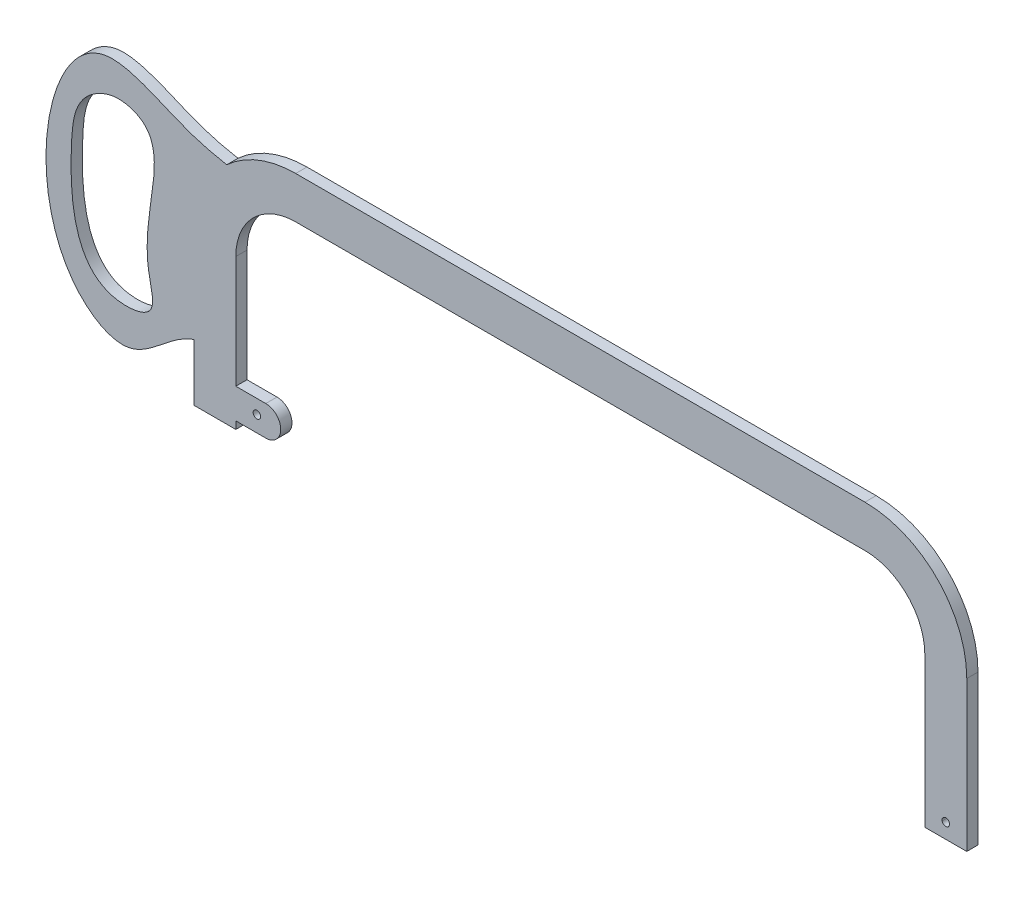
ISO-10303-21;
HEADER;
FILE_DESCRIPTION(('STEP AP214'),'2;1');
FILE_NAME('part.step','',(''),(''),'','','');
FILE_SCHEMA(('AUTOMOTIVE_DESIGN { 1 0 10303 214 1 1 1 1 }'));
ENDSEC;
DATA;
#1=APPLICATION_CONTEXT('core data for automotive mechanical design processes');
#2=APPLICATION_PROTOCOL_DEFINITION('international standard','automotive_design',2000,#1);
#3=PRODUCT_CONTEXT('',#1,'mechanical');
#4=PRODUCT('Part','Part','',(#3));
#5=PRODUCT_RELATED_PRODUCT_CATEGORY('part','',(#4));
#6=PRODUCT_DEFINITION_FORMATION('','',#4);
#7=PRODUCT_DEFINITION_CONTEXT('part definition',#1,'design');
#8=PRODUCT_DEFINITION('design','',#6,#7);
#9=PRODUCT_DEFINITION_SHAPE('','',#8);
#10=(LENGTH_UNIT() NAMED_UNIT(*) SI_UNIT(.MILLI.,.METRE.));
#11=(NAMED_UNIT(*) PLANE_ANGLE_UNIT() SI_UNIT($,.RADIAN.));
#12=(NAMED_UNIT(*) SI_UNIT($,.STERADIAN.) SOLID_ANGLE_UNIT());
#13=UNCERTAINTY_MEASURE_WITH_UNIT(LENGTH_MEASURE(1.E-05),#10,'distance_accuracy_value','');
#14=(GEOMETRIC_REPRESENTATION_CONTEXT(3) GLOBAL_UNCERTAINTY_ASSIGNED_CONTEXT((#13)) GLOBAL_UNIT_ASSIGNED_CONTEXT((#10,
#11,#12)) REPRESENTATION_CONTEXT('',''));
#15=CARTESIAN_POINT('',(0.,0.,0.));
#16=DIRECTION('',(0.,0.,1.));
#17=DIRECTION('',(1.,0.,0.));
#18=AXIS2_PLACEMENT_3D('',#15,#16,#17);
#19=CARTESIAN_POINT('',(124.737182539683,6.35,-2.38125));
#20=DIRECTION('',(0.,0.,1.));
#21=DIRECTION('',(1.,0.,0.));
#22=AXIS2_PLACEMENT_3D('',#19,#20,#21);
#23=CYLINDRICAL_SURFACE('',#22,1.58749999999997);
#24=CARTESIAN_POINT('',(124.737182539683,6.35,-2.38125));
#25=DIRECTION('',(0.,0.,1.));
#26=DIRECTION('',(1.,0.,0.));
#27=AXIS2_PLACEMENT_3D('',#24,#25,#26);
#28=CIRCLE('',#27,1.58749999999997);
#29=CARTESIAN_POINT('',(123.19,5.99449692138973,-2.38125));
#30=VERTEX_POINT('',#29);
#31=CARTESIAN_POINT('',(123.19,6.70550307861028,-2.38125));
#32=VERTEX_POINT('',#31);
#33=EDGE_CURVE('E306',#30,#32,#28,.T.);
#34=ORIENTED_EDGE('',*,*,#33,.F.);
#35=DIRECTION('',(0.,0.,1.));
#36=VECTOR('',#35,1.);
#37=CARTESIAN_POINT('',(123.19,5.99449692138973,-2.38125));
#38=LINE('',#37,#36);
#39=CARTESIAN_POINT('',(123.19,5.99449692138973,2.38125));
#40=VERTEX_POINT('',#39);
#41=EDGE_CURVE('E13',#30,#40,#38,.T.);
#42=ORIENTED_EDGE('',*,*,#41,.T.);
#43=CARTESIAN_POINT('',(124.737182539683,6.35,2.38125));
#44=DIRECTION('',(0.,0.,1.));
#45=DIRECTION('',(1.,0.,0.));
#46=AXIS2_PLACEMENT_3D('',#43,#44,#45);
#47=CIRCLE('',#46,1.58749999999997);
#48=CARTESIAN_POINT('',(123.19,6.70550307861028,2.38125));
#49=VERTEX_POINT('',#48);
#50=EDGE_CURVE('E464',#40,#49,#47,.T.);
#51=ORIENTED_EDGE('',*,*,#50,.T.);
#52=DIRECTION('',(0.,0.,-1.));
#53=VECTOR('',#52,1.);
#54=CARTESIAN_POINT('',(123.19,6.70550307861028,-2.38125));
#55=LINE('',#54,#53);
#56=EDGE_CURVE('E52',#49,#32,#55,.T.);
#57=ORIENTED_EDGE('',*,*,#56,.T.);
#58=EDGE_LOOP('',(#34,#42,#51,#57));
#59=FACE_BOUND('',#58,.T.);
#60=ADVANCED_FACE('F44',(#59),#23,.F.);
#61=CARTESIAN_POINT('',(-176.252817460317,0.,2.38125));
#62=DIRECTION('',(-1.,0.,0.));
#63=DIRECTION('',(0.,-1.,0.));
#64=AXIS2_PLACEMENT_3D('',#61,#62,#63);
#65=PLANE('',#64);
#66=DIRECTION('',(0.,1.,0.));
#67=VECTOR('',#66,1.);
#68=CARTESIAN_POINT('',(-176.252817460317,0.,-2.38125));
#69=LINE('',#68,#67);
#70=CARTESIAN_POINT('',(-176.252817460317,0.,-2.38125));
#71=VERTEX_POINT('',#70);
#72=CARTESIAN_POINT('',(-176.252817460317,3.175,-2.38125));
#73=VERTEX_POINT('',#72);
#74=EDGE_CURVE('E351',#71,#73,#69,.T.);
#75=ORIENTED_EDGE('',*,*,#74,.T.);
#76=DIRECTION('',(0.,0.,1.));
#77=VECTOR('',#76,1.);
#78=CARTESIAN_POINT('',(-176.252817460317,3.175,-25.2765005991963));
#79=LINE('',#78,#77);
#80=CARTESIAN_POINT('',(-176.252817460317,3.175,2.38125));
#81=VERTEX_POINT('',#80);
#82=EDGE_CURVE('E345',#73,#81,#79,.T.);
#83=ORIENTED_EDGE('',*,*,#82,.T.);
#84=DIRECTION('',(0.,1.,0.));
#85=VECTOR('',#84,1.);
#86=CARTESIAN_POINT('',(-176.252817460317,0.,2.38125));
#87=LINE('',#86,#85);
#88=CARTESIAN_POINT('',(-176.252817460317,0.,2.38125));
#89=VERTEX_POINT('',#88);
#90=EDGE_CURVE('E373',#89,#81,#87,.T.);
#91=ORIENTED_EDGE('',*,*,#90,.F.);
#92=DIRECTION('',(0.,0.,-1.));
#93=VECTOR('',#92,1.);
#94=CARTESIAN_POINT('',(-176.252817460317,0.,2.38125));
#95=LINE('',#94,#93);
#96=EDGE_CURVE('E422',#89,#71,#95,.T.);
#97=ORIENTED_EDGE('',*,*,#96,.T.);
#98=EDGE_LOOP('',(#75,#83,#91,#97));
#99=FACE_BOUND('',#98,.T.);
#100=ADVANCED_FACE('F295',(#99),#65,.F.);
#101=CARTESIAN_POINT('',(-194.032817460317,0.,2.38125));
#102=DIRECTION('',(0.,1.,0.));
#103=DIRECTION('',(0.,0.,1.));
#104=AXIS2_PLACEMENT_3D('',#101,#102,#103);
#105=PLANE('',#104);
#106=DIRECTION('',(1.,0.,0.));
#107=VECTOR('',#106,1.);
#108=CARTESIAN_POINT('',(-194.032817460317,0.,-2.38125));
#109=LINE('',#108,#107);
#110=CARTESIAN_POINT('',(-194.032817460317,0.,-2.38125));
#111=VERTEX_POINT('',#110);
#112=EDGE_CURVE('E180',#111,#71,#109,.T.);
#113=ORIENTED_EDGE('',*,*,#112,.T.);
#114=ORIENTED_EDGE('',*,*,#96,.F.);
#115=DIRECTION('',(1.,0.,0.));
#116=VECTOR('',#115,1.);
#117=CARTESIAN_POINT('',(-194.032817460317,0.,2.38125));
#118=LINE('',#117,#116);
#119=CARTESIAN_POINT('',(-194.032817460317,0.,2.38125));
#120=VERTEX_POINT('',#119);
#121=EDGE_CURVE('E184',#120,#89,#118,.T.);
#122=ORIENTED_EDGE('',*,*,#121,.F.);
#123=DIRECTION('',(0.,0.,-1.));
#124=VECTOR('',#123,1.);
#125=CARTESIAN_POINT('',(-194.032817460317,0.,2.38125));
#126=LINE('',#125,#124);
#127=EDGE_CURVE('E427',#120,#111,#126,.T.);
#128=ORIENTED_EDGE('',*,*,#127,.T.);
#129=EDGE_LOOP('',(#113,#114,#122,#128));
#130=FACE_BOUND('',#129,.T.);
#131=ADVANCED_FACE('F46',(#130),#105,.F.);
#132=CARTESIAN_POINT('',(-176.252817460317,15.875,2.38125));
#133=VERTEX_POINT('',#132);
#134=CARTESIAN_POINT('',(-176.252817460317,63.5,2.38125));
#135=VERTEX_POINT('',#134);
#136=EDGE_CURVE('E372',#133,#135,#87,.T.);
#137=ORIENTED_EDGE('',*,*,#136,.F.);
#138=DIRECTION('',(0.,0.,1.));
#139=VECTOR('',#138,1.);
#140=CARTESIAN_POINT('',(-176.252817460317,15.875,-25.2765005991963));
#141=LINE('',#140,#139);
#142=CARTESIAN_POINT('',(-176.252817460317,15.875,-2.38125));
#143=VERTEX_POINT('',#142);
#144=EDGE_CURVE('E338',#143,#133,#141,.T.);
#145=ORIENTED_EDGE('',*,*,#144,.F.);
#146=CARTESIAN_POINT('',(-176.252817460317,63.5,-2.38125));
#147=VERTEX_POINT('',#146);
#148=EDGE_CURVE('E350',#143,#147,#69,.T.);
#149=ORIENTED_EDGE('',*,*,#148,.T.);
#150=DIRECTION('',(0.,0.,-1.));
#151=VECTOR('',#150,1.);
#152=CARTESIAN_POINT('',(-176.252817460317,63.5,2.38125));
#153=LINE('',#152,#151);
#154=EDGE_CURVE('E419',#135,#147,#153,.T.);
#155=ORIENTED_EDGE('',*,*,#154,.F.);
#156=EDGE_LOOP('',(#137,#145,#149,#155));
#157=FACE_BOUND('',#156,.T.);
#158=ADVANCED_FACE('F291',(#157),#65,.F.);
#159=CARTESIAN_POINT('',(-150.852817460317,63.5,2.38125));
#160=DIRECTION('',(0.,0.,-1.));
#161=DIRECTION('',(-1.,0.,0.));
#162=AXIS2_PLACEMENT_3D('',#159,#160,#161);
#163=CYLINDRICAL_SURFACE('',#162,25.4);
#164=CARTESIAN_POINT('',(-150.852817460317,63.5,-2.38125));
#165=DIRECTION('',(0.,0.,-1.));
#166=DIRECTION('',(-1.,0.,0.));
#167=AXIS2_PLACEMENT_3D('',#164,#165,#166);
#168=CIRCLE('',#167,25.4);
#169=CARTESIAN_POINT('',(-150.852817460317,88.9,-2.38125));
#170=VERTEX_POINT('',#169);
#171=EDGE_CURVE('E353',#147,#170,#168,.T.);
#172=ORIENTED_EDGE('',*,*,#171,.T.);
#173=DIRECTION('',(0.,0.,-1.));
#174=VECTOR('',#173,1.);
#175=CARTESIAN_POINT('',(-150.852817460317,88.9,2.38125));
#176=LINE('',#175,#174);
#177=CARTESIAN_POINT('',(-150.852817460317,88.9,2.38125));
#178=VERTEX_POINT('',#177);
#179=EDGE_CURVE('E416',#178,#170,#176,.T.);
#180=ORIENTED_EDGE('',*,*,#179,.F.);
#181=CARTESIAN_POINT('',(-150.852817460317,63.5,2.38125));
#182=DIRECTION('',(0.,0.,-1.));
#183=DIRECTION('',(-1.,0.,0.));
#184=AXIS2_PLACEMENT_3D('',#181,#182,#183);
#185=CIRCLE('',#184,25.4);
#186=EDGE_CURVE('E376',#135,#178,#185,.T.);
#187=ORIENTED_EDGE('',*,*,#186,.F.);
#188=ORIENTED_EDGE('',*,*,#154,.T.);
#189=EDGE_LOOP('',(#172,#180,#187,#188));
#190=FACE_BOUND('',#189,.T.);
#191=ADVANCED_FACE('F288',(#190),#163,.F.);
#192=CARTESIAN_POINT('',(-150.852817460317,88.9,2.38125));
#193=DIRECTION('',(0.,1.,0.));
#194=DIRECTION('',(-1.,0.,0.));
#195=AXIS2_PLACEMENT_3D('',#192,#193,#194);
#196=PLANE('',#195);
#197=DIRECTION('',(1.,0.,0.));
#198=VECTOR('',#197,1.);
#199=CARTESIAN_POINT('',(-150.852817460317,88.9,-2.38125));
#200=LINE('',#199,#198);
#201=CARTESIAN_POINT('',(90.4471825396825,88.9,-2.38125));
#202=VERTEX_POINT('',#201);
#203=EDGE_CURVE('E355',#170,#202,#200,.T.);
#204=ORIENTED_EDGE('',*,*,#203,.T.);
#205=DIRECTION('',(0.,0.,-1.));
#206=VECTOR('',#205,1.);
#207=CARTESIAN_POINT('',(90.4471825396825,88.9,2.38125));
#208=LINE('',#207,#206);
#209=CARTESIAN_POINT('',(90.4471825396825,88.9,2.38125));
#210=VERTEX_POINT('',#209);
#211=EDGE_CURVE('E412',#210,#202,#208,.T.);
#212=ORIENTED_EDGE('',*,*,#211,.F.);
#213=DIRECTION('',(1.,0.,0.));
#214=VECTOR('',#213,1.);
#215=CARTESIAN_POINT('',(-150.852817460317,88.9,2.38125));
#216=LINE('',#215,#214);
#217=EDGE_CURVE('E378',#178,#210,#216,.T.);
#218=ORIENTED_EDGE('',*,*,#217,.F.);
#219=ORIENTED_EDGE('',*,*,#179,.T.);
#220=EDGE_LOOP('',(#204,#212,#218,#219));
#221=FACE_BOUND('',#220,.T.);
#222=ADVANCED_FACE('F284',(#221),#196,.F.);
#223=CARTESIAN_POINT('',(90.4471825396825,63.5,2.38125));
#224=DIRECTION('',(0.,0.,-1.));
#225=DIRECTION('',(-1.,0.,0.));
#226=AXIS2_PLACEMENT_3D('',#223,#224,#225);
#227=CYLINDRICAL_SURFACE('',#226,25.4);
#228=CARTESIAN_POINT('',(90.4471825396825,63.5,-2.38125));
#229=DIRECTION('',(0.,0.,-1.));
#230=DIRECTION('',(1.,0.,0.));
#231=AXIS2_PLACEMENT_3D('',#228,#229,#230);
#232=CIRCLE('',#231,25.4);
#233=CARTESIAN_POINT('',(115.847182539683,63.5,-2.38125));
#234=VERTEX_POINT('',#233);
#235=EDGE_CURVE('E357',#202,#234,#232,.T.);
#236=ORIENTED_EDGE('',*,*,#235,.T.);
#237=DIRECTION('',(0.,0.,-1.));
#238=VECTOR('',#237,1.);
#239=CARTESIAN_POINT('',(115.847182539683,63.5,2.38125));
#240=LINE('',#239,#238);
#241=CARTESIAN_POINT('',(115.847182539683,63.5,2.38125));
#242=VERTEX_POINT('',#241);
#243=EDGE_CURVE('E410',#242,#234,#240,.T.);
#244=ORIENTED_EDGE('',*,*,#243,.F.);
#245=CARTESIAN_POINT('',(90.4471825396825,63.5,2.38125));
#246=DIRECTION('',(0.,0.,-1.));
#247=DIRECTION('',(1.,0.,0.));
#248=AXIS2_PLACEMENT_3D('',#245,#246,#247);
#249=CIRCLE('',#248,25.4);
#250=EDGE_CURVE('E380',#210,#242,#249,.T.);
#251=ORIENTED_EDGE('',*,*,#250,.F.);
#252=ORIENTED_EDGE('',*,*,#211,.T.);
#253=EDGE_LOOP('',(#236,#244,#251,#252));
#254=FACE_BOUND('',#253,.T.);
#255=ADVANCED_FACE('F280',(#254),#227,.F.);
#256=CARTESIAN_POINT('',(115.847182539683,63.5,2.38125));
#257=DIRECTION('',(1.,0.,0.));
#258=DIRECTION('',(0.,0.,-1.));
#259=AXIS2_PLACEMENT_3D('',#256,#257,#258);
#260=PLANE('',#259);
#261=DIRECTION('',(0.,-1.,0.));
#262=VECTOR('',#261,1.);
#263=CARTESIAN_POINT('',(115.847182539683,63.5,-2.38125));
#264=LINE('',#263,#262);
#265=CARTESIAN_POINT('',(115.847182539683,0.,-2.38125));
#266=VERTEX_POINT('',#265);
#267=EDGE_CURVE('E359',#234,#266,#264,.T.);
#268=ORIENTED_EDGE('',*,*,#267,.T.);
#269=DIRECTION('',(0.,0.,-1.));
#270=VECTOR('',#269,1.);
#271=CARTESIAN_POINT('',(115.847182539683,0.,2.38125));
#272=LINE('',#271,#270);
#273=CARTESIAN_POINT('',(115.847182539683,0.,2.38125));
#274=VERTEX_POINT('',#273);
#275=EDGE_CURVE('E407',#274,#266,#272,.T.);
#276=ORIENTED_EDGE('',*,*,#275,.F.);
#277=DIRECTION('',(0.,-1.,0.));
#278=VECTOR('',#277,1.);
#279=CARTESIAN_POINT('',(115.847182539683,63.5,2.38125));
#280=LINE('',#279,#278);
#281=EDGE_CURVE('E382',#242,#274,#280,.T.);
#282=ORIENTED_EDGE('',*,*,#281,.F.);
#283=ORIENTED_EDGE('',*,*,#243,.T.);
#284=EDGE_LOOP('',(#268,#276,#282,#283));
#285=FACE_BOUND('',#284,.T.);
#286=ADVANCED_FACE('F276',(#285),#260,.F.);
#287=CARTESIAN_POINT('',(115.847182539683,0.,2.38125));
#288=DIRECTION('',(0.,1.,0.));
#289=DIRECTION('',(0.,0.,1.));
#290=AXIS2_PLACEMENT_3D('',#287,#288,#289);
#291=PLANE('',#290);
#292=DIRECTION('',(1.,0.,0.));
#293=VECTOR('',#292,1.);
#294=CARTESIAN_POINT('',(115.847182539683,0.,-2.38125));
#295=LINE('',#294,#293);
#296=CARTESIAN_POINT('',(133.627182539683,0.,-2.38125));
#297=VERTEX_POINT('',#296);
#298=EDGE_CURVE('E361',#266,#297,#295,.T.);
#299=ORIENTED_EDGE('',*,*,#298,.T.);
#300=DIRECTION('',(0.,0.,-1.));
#301=VECTOR('',#300,1.);
#302=CARTESIAN_POINT('',(133.627182539683,0.,2.38125));
#303=LINE('',#302,#301);
#304=CARTESIAN_POINT('',(133.627182539683,0.,2.38125));
#305=VERTEX_POINT('',#304);
#306=EDGE_CURVE('E404',#305,#297,#303,.T.);
#307=ORIENTED_EDGE('',*,*,#306,.F.);
#308=DIRECTION('',(1.,0.,0.));
#309=VECTOR('',#308,1.);
#310=CARTESIAN_POINT('',(115.847182539683,0.,2.38125));
#311=LINE('',#310,#309);
#312=EDGE_CURVE('E383',#274,#305,#311,.T.);
#313=ORIENTED_EDGE('',*,*,#312,.F.);
#314=ORIENTED_EDGE('',*,*,#275,.T.);
#315=EDGE_LOOP('',(#299,#307,#313,#314));
#316=FACE_BOUND('',#315,.T.);
#317=ADVANCED_FACE('F272',(#316),#291,.F.);
#318=CARTESIAN_POINT('',(133.627182539683,0.,2.38125));
#319=DIRECTION('',(-1.,0.,0.));
#320=DIRECTION('',(0.,0.,1.));
#321=AXIS2_PLACEMENT_3D('',#318,#319,#320);
#322=PLANE('',#321);
#323=DIRECTION('',(0.,1.,0.));
#324=VECTOR('',#323,1.);
#325=CARTESIAN_POINT('',(133.627182539683,0.,-2.38125));
#326=LINE('',#325,#324);
#327=CARTESIAN_POINT('',(133.627182539683,63.5,-2.38125));
#328=VERTEX_POINT('',#327);
#329=EDGE_CURVE('E363',#297,#328,#326,.T.);
#330=ORIENTED_EDGE('',*,*,#329,.T.);
#331=DIRECTION('',(0.,0.,-1.));
#332=VECTOR('',#331,1.);
#333=CARTESIAN_POINT('',(133.627182539683,63.5,2.38125));
#334=LINE('',#333,#332);
#335=CARTESIAN_POINT('',(133.627182539683,63.5,2.38125));
#336=VERTEX_POINT('',#335);
#337=EDGE_CURVE('E399',#336,#328,#334,.T.);
#338=ORIENTED_EDGE('',*,*,#337,.F.);
#339=DIRECTION('',(0.,1.,0.));
#340=VECTOR('',#339,1.);
#341=CARTESIAN_POINT('',(133.627182539683,0.,2.38125));
#342=LINE('',#341,#340);
#343=EDGE_CURVE('E387',#305,#336,#342,.T.);
#344=ORIENTED_EDGE('',*,*,#343,.F.);
#345=ORIENTED_EDGE('',*,*,#306,.T.);
#346=EDGE_LOOP('',(#330,#338,#344,#345));
#347=FACE_BOUND('',#346,.T.);
#348=ADVANCED_FACE('F268',(#347),#322,.F.);
#349=CARTESIAN_POINT('',(90.4471825396825,63.5,2.38125));
#350=DIRECTION('',(0.,0.,-1.));
#351=DIRECTION('',(-1.,0.,0.));
#352=AXIS2_PLACEMENT_3D('',#349,#350,#351);
#353=CYLINDRICAL_SURFACE('',#352,43.18);
#354=CARTESIAN_POINT('',(90.4471825396825,63.5,-2.38125));
#355=DIRECTION('',(0.,0.,1.));
#356=DIRECTION('',(1.,0.,0.));
#357=AXIS2_PLACEMENT_3D('',#354,#355,#356);
#358=CIRCLE('',#357,43.18);
#359=CARTESIAN_POINT('',(90.4471825396825,106.68,-2.38125));
#360=VERTEX_POINT('',#359);
#361=EDGE_CURVE('E365',#328,#360,#358,.T.);
#362=ORIENTED_EDGE('',*,*,#361,.T.);
#363=DIRECTION('',(0.,0.,-1.));
#364=VECTOR('',#363,1.);
#365=CARTESIAN_POINT('',(90.4471825396825,106.68,2.38125));
#366=LINE('',#365,#364);
#367=CARTESIAN_POINT('',(90.4471825396825,106.68,2.38125));
#368=VERTEX_POINT('',#367);
#369=EDGE_CURVE('E394',#368,#360,#366,.T.);
#370=ORIENTED_EDGE('',*,*,#369,.F.);
#371=CARTESIAN_POINT('',(90.4471825396825,63.5,2.38125));
#372=DIRECTION('',(0.,0.,1.));
#373=DIRECTION('',(1.,0.,0.));
#374=AXIS2_PLACEMENT_3D('',#371,#372,#373);
#375=CIRCLE('',#374,43.18);
#376=EDGE_CURVE('E435',#336,#368,#375,.T.);
#377=ORIENTED_EDGE('',*,*,#376,.F.);
#378=ORIENTED_EDGE('',*,*,#337,.T.);
#379=EDGE_LOOP('',(#362,#370,#377,#378));
#380=FACE_BOUND('',#379,.T.);
#381=ADVANCED_FACE('F264',(#380),#353,.T.);
#382=CARTESIAN_POINT('',(90.4471825396825,106.68,2.38125));
#383=DIRECTION('',(0.,-1.,0.));
#384=DIRECTION('',(1.,0.,0.));
#385=AXIS2_PLACEMENT_3D('',#382,#383,#384);
#386=PLANE('',#385);
#387=DIRECTION('',(-1.,0.,0.));
#388=VECTOR('',#387,1.);
#389=CARTESIAN_POINT('',(90.4471825396825,106.68,-2.38125));
#390=LINE('',#389,#388);
#391=CARTESIAN_POINT('',(-150.852817460317,106.68,-2.38125));
#392=VERTEX_POINT('',#391);
#393=EDGE_CURVE('E367',#360,#392,#390,.T.);
#394=ORIENTED_EDGE('',*,*,#393,.T.);
#395=DIRECTION('',(0.,0.,-1.));
#396=VECTOR('',#395,1.);
#397=CARTESIAN_POINT('',(-150.852817460317,106.68,2.38125));
#398=LINE('',#397,#396);
#399=CARTESIAN_POINT('',(-150.852817460317,106.68,2.38125));
#400=VERTEX_POINT('',#399);
#401=EDGE_CURVE('E400',#400,#392,#398,.T.);
#402=ORIENTED_EDGE('',*,*,#401,.F.);
#403=DIRECTION('',(-1.,0.,0.));
#404=VECTOR('',#403,1.);
#405=CARTESIAN_POINT('',(90.4471825396825,106.68,2.38125));
#406=LINE('',#405,#404);
#407=EDGE_CURVE('E434',#368,#400,#406,.T.);
#408=ORIENTED_EDGE('',*,*,#407,.F.);
#409=ORIENTED_EDGE('',*,*,#369,.T.);
#410=EDGE_LOOP('',(#394,#402,#408,#409));
#411=FACE_BOUND('',#410,.T.);
#412=ADVANCED_FACE('F260',(#411),#386,.F.);
#413=CARTESIAN_POINT('',(-150.852817460317,63.5,2.38125));
#414=DIRECTION('',(0.,0.,-1.));
#415=DIRECTION('',(-1.,0.,0.));
#416=AXIS2_PLACEMENT_3D('',#413,#414,#415);
#417=CYLINDRICAL_SURFACE('',#416,43.18);
#418=CARTESIAN_POINT('',(-150.852817460317,63.5,-2.38125));
#419=DIRECTION('',(0.,0.,1.));
#420=DIRECTION('',(-1.,0.,0.));
#421=AXIS2_PLACEMENT_3D('',#418,#419,#420);
#422=CIRCLE('',#421,43.18);
#423=CARTESIAN_POINT('',(-180.094894680852,95.2712656315155,-2.38125));
#424=VERTEX_POINT('',#423);
#425=EDGE_CURVE('E185',#392,#424,#422,.T.);
#426=ORIENTED_EDGE('',*,*,#425,.T.);
#427=DIRECTION('',(0.,0.,1.));
#428=VECTOR('',#427,1.);
#429=CARTESIAN_POINT('',(-180.094894680852,95.2712656315155,0.));
#430=LINE('',#429,#428);
#431=CARTESIAN_POINT('',(-180.094894680852,95.2712656315155,2.38125));
#432=VERTEX_POINT('',#431);
#433=EDGE_CURVE('E194',#424,#432,#430,.T.);
#434=ORIENTED_EDGE('',*,*,#433,.T.);
#435=CARTESIAN_POINT('',(-150.852817460317,63.5,2.38125));
#436=DIRECTION('',(0.,0.,1.));
#437=DIRECTION('',(-1.,0.,0.));
#438=AXIS2_PLACEMENT_3D('',#435,#436,#437);
#439=CIRCLE('',#438,43.18);
#440=EDGE_CURVE('E429',#400,#432,#439,.T.);
#441=ORIENTED_EDGE('',*,*,#440,.F.);
#442=ORIENTED_EDGE('',*,*,#401,.T.);
#443=EDGE_LOOP('',(#426,#434,#441,#442));
#444=FACE_BOUND('',#443,.T.);
#445=ADVANCED_FACE('F257',(#444),#417,.T.);
#446=CARTESIAN_POINT('',(-194.032817460317,63.5,2.38125));
#447=DIRECTION('',(1.,0.,0.));
#448=DIRECTION('',(0.,1.,0.));
#449=AXIS2_PLACEMENT_3D('',#446,#447,#448);
#450=PLANE('',#449);
#451=DIRECTION('',(0.,-1.,0.));
#452=VECTOR('',#451,1.);
#453=CARTESIAN_POINT('',(-194.032817460317,63.5,2.38125));
#454=LINE('',#453,#452);
#455=CARTESIAN_POINT('',(-194.032817460317,24.1205061199108,2.38125));
#456=VERTEX_POINT('',#455);
#457=EDGE_CURVE('E190',#456,#120,#454,.T.);
#458=ORIENTED_EDGE('',*,*,#457,.F.);
#459=DIRECTION('',(0.,0.,1.));
#460=VECTOR('',#459,1.);
#461=CARTESIAN_POINT('',(-194.032817460317,24.1205061199112,0.));
#462=LINE('',#461,#460);
#463=CARTESIAN_POINT('',(-194.032817460319,24.1205061199108,-2.38125));
#464=VERTEX_POINT('',#463);
#465=EDGE_CURVE('E188',#456,#464,#462,.F.);
#466=ORIENTED_EDGE('',*,*,#465,.T.);
#467=DIRECTION('',(0.,-1.,0.));
#468=VECTOR('',#467,1.);
#469=CARTESIAN_POINT('',(-194.032817460317,63.5,-2.38125));
#470=LINE('',#469,#468);
#471=EDGE_CURVE('E172',#464,#111,#470,.T.);
#472=ORIENTED_EDGE('',*,*,#471,.T.);
#473=ORIENTED_EDGE('',*,*,#127,.F.);
#474=EDGE_LOOP('',(#458,#466,#472,#473));
#475=FACE_BOUND('',#474,.T.);
#476=ADVANCED_FACE('F189',(#475),#450,.F.);
#477=CARTESIAN_POINT('',(-150.852817460317,63.5,2.38125));
#478=DIRECTION('',(0.,0.,-1.));
#479=DIRECTION('',(-1.,0.,0.));
#480=AXIS2_PLACEMENT_3D('',#477,#478,#479);
#481=PLANE('',#480);
#482=ORIENTED_EDGE('',*,*,#440,.T.);
#483=CARTESIAN_POINT('',(-163.50008603373,92.9767178813179,2.38125));
#484=CARTESIAN_POINT('',(-174.215818284095,94.2300992189467,2.38125));
#485=CARTESIAN_POINT('',(-196.776448036714,96.8689363638482,2.38125));
#486=CARTESIAN_POINT('',(-252.859222163881,130.124714633944,2.38125));
#487=CARTESIAN_POINT('',(-269.426470803475,29.793267068146,2.38125));
#488=CARTESIAN_POINT('',(-217.090656666542,-1.29085573981712,2.38125));
#489=CARTESIAN_POINT('',(-200.757769768453,26.3378115151783,2.38125));
#490=CARTESIAN_POINT('',(-186.899721404846,24.7198097405488,2.38125));
#491=CARTESIAN_POINT('',(-185.37100561647,24.541323939836,2.38125));
#492=B_SPLINE_CURVE_WITH_KNOTS('',3,(#483,#484,#485,#486,#487,#488,#489,#490,#491),
.UNSPECIFIED.,.F.,.F.,(4,1,1,1,1,1,4),(0.,0.145421676533469,0.306167093916027,0.711218283048218,
0.818840041352885,0.980015794306756,1.),.UNSPECIFIED.);
#493=EDGE_CURVE('E202',#432,#456,#492,.T.);
#494=ORIENTED_EDGE('',*,*,#493,.T.);
#495=ORIENTED_EDGE('',*,*,#457,.T.);
#496=ORIENTED_EDGE('',*,*,#121,.T.);
#497=ORIENTED_EDGE('',*,*,#90,.T.);
#498=DIRECTION('',(1.,0.,0.));
#499=VECTOR('',#498,1.);
#500=CARTESIAN_POINT('',(-176.252817460317,3.175,2.38125));
#501=LINE('',#500,#499);
#502=CARTESIAN_POINT('',(-163.552817460317,3.175,2.38125));
#503=VERTEX_POINT('',#502);
#504=EDGE_CURVE('E322',#81,#503,#501,.T.);
#505=ORIENTED_EDGE('',*,*,#504,.T.);
#506=CARTESIAN_POINT('',(-163.552817460317,9.525,2.38125));
#507=DIRECTION('',(0.,0.,1.));
#508=DIRECTION('',(1.,0.,0.));
#509=AXIS2_PLACEMENT_3D('',#506,#507,#508);
#510=CIRCLE('',#509,6.35);
#511=CARTESIAN_POINT('',(-163.552817460317,15.875,2.38125));
#512=VERTEX_POINT('',#511);
#513=EDGE_CURVE('E327',#503,#512,#510,.T.);
#514=ORIENTED_EDGE('',*,*,#513,.T.);
#515=DIRECTION('',(-1.,0.,0.));
#516=VECTOR('',#515,1.);
#517=CARTESIAN_POINT('',(-176.252817460317,15.875,2.38125));
#518=LINE('',#517,#516);
#519=EDGE_CURVE('E323',#512,#133,#518,.T.);
#520=ORIENTED_EDGE('',*,*,#519,.T.);
#521=ORIENTED_EDGE('',*,*,#136,.T.);
#522=ORIENTED_EDGE('',*,*,#186,.T.);
#523=ORIENTED_EDGE('',*,*,#217,.T.);
#524=ORIENTED_EDGE('',*,*,#250,.T.);
#525=ORIENTED_EDGE('',*,*,#281,.T.);
#526=ORIENTED_EDGE('',*,*,#312,.T.);
#527=ORIENTED_EDGE('',*,*,#343,.T.);
#528=ORIENTED_EDGE('',*,*,#376,.T.);
#529=ORIENTED_EDGE('',*,*,#407,.T.);
#530=EDGE_LOOP('',(#482,#494,#495,#496,#497,#505,#514,#520,#521,#522,#523,#524,#525,#526,#527,
#528,#529));
#531=FACE_BOUND('',#530,.T.);
#532=EDGE_CURVE('E310',#49,#40,#47,.T.);
#533=ORIENTED_EDGE('',*,*,#532,.F.);
#534=ORIENTED_EDGE('',*,*,#50,.F.);
#535=EDGE_LOOP('',(#533,#534));
#536=FACE_BOUND('',#535,.T.);
#537=CARTESIAN_POINT('',(-167.336278270076,9.93855216538009,2.38125));
#538=DIRECTION('',(0.,0.,1.));
#539=DIRECTION('',(1.,0.,0.));
#540=AXIS2_PLACEMENT_3D('',#537,#538,#539);
#541=CIRCLE('',#540,1.58749999999999);
#542=CARTESIAN_POINT('',(-165.748778270076,9.93855216538009,2.38125));
#543=VERTEX_POINT('',#542);
#544=EDGE_CURVE('E313',#543,#543,#541,.T.);
#545=ORIENTED_EDGE('',*,*,#544,.F.);
#546=EDGE_LOOP('',(#545));
#547=FACE_BOUND('',#546,.T.);
#548=CARTESIAN_POINT('',(-241.011953679969,88.8094623745175,2.38125));
#549=CARTESIAN_POINT('',(-244.988611476123,83.6487410239102,2.38125));
#550=CARTESIAN_POINT('',(-247.283551881555,60.1055409584341,2.38125));
#551=CARTESIAN_POINT('',(-244.915722390433,18.8537352838272,2.38125));
#552=CARTESIAN_POINT('',(-208.081682807615,23.1237234693048,2.38125));
#553=CARTESIAN_POINT('',(-220.297957576784,55.3931547391515,2.38125));
#554=CARTESIAN_POINT('',(-201.095560901441,90.7405361068269,2.38125));
#555=CARTESIAN_POINT('',(-229.023756485265,98.1268585883008,2.38125));
#556=CARTESIAN_POINT('',(-237.642234652288,93.1825268480365,2.38125));
#557=CARTESIAN_POINT('',(-241.011953679969,88.8094623745175,2.38125));
#558=B_SPLINE_CURVE_WITH_KNOTS('',3,(#548,#549,#550,#551,#552,#553,#554,#555,#556,#557),
.UNSPECIFIED.,.T.,.F.,(4,1,1,1,1,1,1,4),(0.,0.110817881329757,0.392381603405073,
0.47396519666166,0.559095552804665,0.859488043987518,0.906095736051165,1.),.UNSPECIFIED.);
#559=CARTESIAN_POINT('',(-241.011953679969,88.8094623745175,2.38125));
#560=VERTEX_POINT('',#559);
#561=EDGE_CURVE('E199',#560,#560,#558,.T.);
#562=ORIENTED_EDGE('',*,*,#561,.F.);
#563=EDGE_LOOP('',(#562));
#564=FACE_BOUND('',#563,.T.);
#565=ADVANCED_FACE('F251',(#531,#536,#547,#564),#481,.F.);
#566=CARTESIAN_POINT('',(-150.852817460317,63.5,-2.38125));
#567=DIRECTION('',(0.,0.,-1.));
#568=DIRECTION('',(-1.,0.,0.));
#569=AXIS2_PLACEMENT_3D('',#566,#567,#568);
#570=PLANE('',#569);
#571=ORIENTED_EDGE('',*,*,#471,.F.);
#572=CARTESIAN_POINT('',(-163.50008603373,92.9767178813179,-2.38125));
#573=CARTESIAN_POINT('',(-174.215818284095,94.2300992189467,-2.38125));
#574=CARTESIAN_POINT('',(-196.776448036714,96.8689363638482,-2.38125));
#575=CARTESIAN_POINT('',(-252.859222163881,130.124714633944,-2.38125));
#576=CARTESIAN_POINT('',(-269.426470803475,29.793267068146,-2.38125));
#577=CARTESIAN_POINT('',(-217.090656666542,-1.29085573981712,-2.38125));
#578=CARTESIAN_POINT('',(-200.757769768453,26.3378115151783,-2.38125));
#579=CARTESIAN_POINT('',(-186.899721404846,24.7198097405488,-2.38125));
#580=CARTESIAN_POINT('',(-185.37100561647,24.541323939836,-2.38125));
#581=B_SPLINE_CURVE_WITH_KNOTS('',3,(#572,#573,#574,#575,#576,#577,#578,#579,#580),
.UNSPECIFIED.,.F.,.F.,(4,1,1,1,1,1,4),(0.,0.145421676533469,0.306167093916027,0.711218283048218,
0.818840041352885,0.980015794306756,1.),.UNSPECIFIED.);
#582=EDGE_CURVE('E178',#424,#464,#581,.T.);
#583=ORIENTED_EDGE('',*,*,#582,.F.);
#584=ORIENTED_EDGE('',*,*,#425,.F.);
#585=ORIENTED_EDGE('',*,*,#393,.F.);
#586=ORIENTED_EDGE('',*,*,#361,.F.);
#587=ORIENTED_EDGE('',*,*,#329,.F.);
#588=ORIENTED_EDGE('',*,*,#298,.F.);
#589=ORIENTED_EDGE('',*,*,#267,.F.);
#590=ORIENTED_EDGE('',*,*,#235,.F.);
#591=ORIENTED_EDGE('',*,*,#203,.F.);
#592=ORIENTED_EDGE('',*,*,#171,.F.);
#593=ORIENTED_EDGE('',*,*,#148,.F.);
#594=DIRECTION('',(-1.,0.,0.));
#595=VECTOR('',#594,1.);
#596=CARTESIAN_POINT('',(-176.252817460317,15.875,-2.38125));
#597=LINE('',#596,#595);
#598=CARTESIAN_POINT('',(-163.552817460317,15.875,-2.38125));
#599=VERTEX_POINT('',#598);
#600=EDGE_CURVE('E335',#599,#143,#597,.T.);
#601=ORIENTED_EDGE('',*,*,#600,.F.);
#602=CARTESIAN_POINT('',(-163.552817460317,9.525,-2.38125));
#603=DIRECTION('',(0.,0.,-1.));
#604=DIRECTION('',(-1.,0.,0.));
#605=AXIS2_PLACEMENT_3D('',#602,#603,#604);
#606=CIRCLE('',#605,6.35);
#607=CARTESIAN_POINT('',(-163.552817460317,3.175,-2.38125));
#608=VERTEX_POINT('',#607);
#609=EDGE_CURVE('E340',#608,#599,#606,.F.);
#610=ORIENTED_EDGE('',*,*,#609,.F.);
#611=DIRECTION('',(1.,0.,0.));
#612=VECTOR('',#611,1.);
#613=CARTESIAN_POINT('',(-176.252817460317,3.175,-2.38125));
#614=LINE('',#613,#612);
#615=EDGE_CURVE('E326',#73,#608,#614,.T.);
#616=ORIENTED_EDGE('',*,*,#615,.F.);
#617=ORIENTED_EDGE('',*,*,#74,.F.);
#618=ORIENTED_EDGE('',*,*,#112,.F.);
#619=EDGE_LOOP('',(#571,#583,#584,#585,#586,#587,#588,#589,#590,#591,#592,#593,#601,#610,#616,
#617,#618));
#620=FACE_BOUND('',#619,.T.);
#621=EDGE_CURVE('E309',#32,#30,#28,.T.);
#622=ORIENTED_EDGE('',*,*,#621,.T.);
#623=ORIENTED_EDGE('',*,*,#33,.T.);
#624=EDGE_LOOP('',(#622,#623));
#625=FACE_BOUND('',#624,.T.);
#626=CARTESIAN_POINT('',(-167.336278270076,9.93855216538009,-2.38125));
#627=DIRECTION('',(0.,0.,1.));
#628=DIRECTION('',(1.,0.,0.));
#629=AXIS2_PLACEMENT_3D('',#626,#627,#628);
#630=CIRCLE('',#629,1.58749999999999);
#631=CARTESIAN_POINT('',(-165.748778270076,9.93855216538009,-2.38125));
#632=VERTEX_POINT('',#631);
#633=EDGE_CURVE('E315',#632,#632,#630,.T.);
#634=ORIENTED_EDGE('',*,*,#633,.T.);
#635=EDGE_LOOP('',(#634));
#636=FACE_BOUND('',#635,.T.);
#637=CARTESIAN_POINT('',(-241.011953679969,88.8094623745175,-2.38125));
#638=CARTESIAN_POINT('',(-244.988611476123,83.6487410239102,-2.38125));
#639=CARTESIAN_POINT('',(-247.283551881555,60.1055409584341,-2.38125));
#640=CARTESIAN_POINT('',(-244.915722390433,18.8537352838272,-2.38125));
#641=CARTESIAN_POINT('',(-208.081682807615,23.1237234693048,-2.38125));
#642=CARTESIAN_POINT('',(-220.297957576784,55.3931547391515,-2.38125));
#643=CARTESIAN_POINT('',(-201.095560901441,90.7405361068269,-2.38125));
#644=CARTESIAN_POINT('',(-229.023756485265,98.1268585883008,-2.38125));
#645=CARTESIAN_POINT('',(-237.642234652288,93.1825268480365,-2.38125));
#646=CARTESIAN_POINT('',(-241.011953679969,88.8094623745175,-2.38125));
#647=B_SPLINE_CURVE_WITH_KNOTS('',3,(#637,#638,#639,#640,#641,#642,#643,#644,#645,#646),
.UNSPECIFIED.,.T.,.F.,(4,1,1,1,1,1,1,4),(0.,0.110817881329757,0.392381603405073,
0.47396519666166,0.559095552804665,0.859488043987518,0.906095736051165,1.),.UNSPECIFIED.);
#648=CARTESIAN_POINT('',(-241.011953679969,88.8094623745175,-2.38125));
#649=VERTEX_POINT('',#648);
#650=EDGE_CURVE('E195',#649,#649,#647,.T.);
#651=ORIENTED_EDGE('',*,*,#650,.T.);
#652=EDGE_LOOP('',(#651));
#653=FACE_BOUND('',#652,.T.);
#654=ADVANCED_FACE('F174',(#620,#625,#636,#653),#570,.T.);
#655=CARTESIAN_POINT('',(-176.252817460317,3.175,-25.2765005991963));
#656=DIRECTION('',(0.,-1.,0.));
#657=DIRECTION('',(0.,0.,-1.));
#658=AXIS2_PLACEMENT_3D('',#655,#656,#657);
#659=PLANE('',#658);
#660=ORIENTED_EDGE('',*,*,#82,.F.);
#661=ORIENTED_EDGE('',*,*,#615,.T.);
#662=DIRECTION('',(0.,0.,1.));
#663=VECTOR('',#662,1.);
#664=CARTESIAN_POINT('',(-163.552817460317,3.175,-25.2765005991963));
#665=LINE('',#664,#663);
#666=EDGE_CURVE('E334',#608,#503,#665,.T.);
#667=ORIENTED_EDGE('',*,*,#666,.T.);
#668=ORIENTED_EDGE('',*,*,#504,.F.);
#669=EDGE_LOOP('',(#660,#661,#667,#668));
#670=FACE_BOUND('',#669,.T.);
#671=ADVANCED_FACE('F244',(#670),#659,.T.);
#672=CARTESIAN_POINT('',(-163.552817460317,9.525,-25.2765005991963));
#673=DIRECTION('',(0.,0.,1.));
#674=DIRECTION('',(1.,0.,0.));
#675=AXIS2_PLACEMENT_3D('',#672,#673,#674);
#676=CYLINDRICAL_SURFACE('',#675,6.35);
#677=ORIENTED_EDGE('',*,*,#666,.F.);
#678=ORIENTED_EDGE('',*,*,#609,.T.);
#679=DIRECTION('',(0.,0.,1.));
#680=VECTOR('',#679,1.);
#681=CARTESIAN_POINT('',(-163.552817460317,15.875,-25.2765005991963));
#682=LINE('',#681,#680);
#683=EDGE_CURVE('E339',#599,#512,#682,.T.);
#684=ORIENTED_EDGE('',*,*,#683,.T.);
#685=ORIENTED_EDGE('',*,*,#513,.F.);
#686=EDGE_LOOP('',(#677,#678,#684,#685));
#687=FACE_BOUND('',#686,.T.);
#688=ADVANCED_FACE('F240',(#687),#676,.T.);
#689=CARTESIAN_POINT('',(-176.252817460317,15.875,-25.2765005991963));
#690=DIRECTION('',(0.,1.,0.));
#691=DIRECTION('',(0.,0.,1.));
#692=AXIS2_PLACEMENT_3D('',#689,#690,#691);
#693=PLANE('',#692);
#694=ORIENTED_EDGE('',*,*,#683,.F.);
#695=ORIENTED_EDGE('',*,*,#600,.T.);
#696=ORIENTED_EDGE('',*,*,#144,.T.);
#697=ORIENTED_EDGE('',*,*,#519,.F.);
#698=EDGE_LOOP('',(#694,#695,#696,#697));
#699=FACE_BOUND('',#698,.T.);
#700=ADVANCED_FACE('F236',(#699),#693,.T.);
#701=CARTESIAN_POINT('',(-167.336278270076,9.93855216538009,-2.38125));
#702=DIRECTION('',(0.,0.,1.));
#703=DIRECTION('',(1.,0.,0.));
#704=AXIS2_PLACEMENT_3D('',#701,#702,#703);
#705=CYLINDRICAL_SURFACE('',#704,1.58749999999999);
#706=ORIENTED_EDGE('',*,*,#633,.F.);
#707=EDGE_LOOP('',(#706));
#708=FACE_BOUND('',#707,.T.);
#709=ORIENTED_EDGE('',*,*,#544,.T.);
#710=EDGE_LOOP('',(#709));
#711=FACE_BOUND('',#710,.T.);
#712=ADVANCED_FACE('F233',(#708,#711),#705,.F.);
#713=ORIENTED_EDGE('',*,*,#41,.F.);
#714=ORIENTED_EDGE('',*,*,#621,.F.);
#715=ORIENTED_EDGE('',*,*,#56,.F.);
#716=ORIENTED_EDGE('',*,*,#532,.T.);
#717=EDGE_LOOP('',(#713,#714,#715,#716));
#718=FACE_BOUND('',#717,.T.);
#719=ADVANCED_FACE('F227',(#718),#23,.F.);
#720=CARTESIAN_POINT('',(-163.50008603373,92.9767178813179,-143.124890978681));
#721=CARTESIAN_POINT('',(-174.215818284095,94.2300992189467,-143.124890978681));
#722=CARTESIAN_POINT('',(-196.776448036714,96.8689363638482,-143.124890978681));
#723=CARTESIAN_POINT('',(-252.859222163881,130.124714633944,-143.124890978681));
#724=CARTESIAN_POINT('',(-269.426470803475,29.793267068146,-143.124890978681));
#725=CARTESIAN_POINT('',(-217.090656666542,-1.29085573981712,-143.124890978681));
#726=CARTESIAN_POINT('',(-200.757769768453,26.3378115151783,-143.124890978681));
#727=CARTESIAN_POINT('',(-186.899721404846,24.7198097405488,-143.124890978681));
#728=CARTESIAN_POINT('',(-185.37100561647,24.541323939836,-143.124890978681));
#729=B_SPLINE_CURVE_WITH_KNOTS('',3,(#720,#721,#722,#723,#724,#725,#726,#727,#728),
.UNSPECIFIED.,.F.,.F.,(4,1,1,1,1,1,4),(0.,0.145421676533469,0.306167093916027,0.711218283048218,
0.818840041352885,0.980015794306756,1.),.UNSPECIFIED.);
#730=DIRECTION('',(0.,0.,1.));
#731=VECTOR('',#730,1.);
#732=SURFACE_OF_LINEAR_EXTRUSION('',#729,#731);
#733=ORIENTED_EDGE('',*,*,#433,.F.);
#734=ORIENTED_EDGE('',*,*,#582,.T.);
#735=ORIENTED_EDGE('',*,*,#465,.F.);
#736=ORIENTED_EDGE('',*,*,#493,.F.);
#737=EDGE_LOOP('',(#733,#734,#735,#736));
#738=FACE_BOUND('',#737,.T.);
#739=ADVANCED_FACE('F198',(#738),#732,.T.);
#740=CARTESIAN_POINT('',(-241.011953679969,88.8094623745175,-143.124890978681));
#741=CARTESIAN_POINT('',(-244.988611476123,83.6487410239102,-143.124890978681));
#742=CARTESIAN_POINT('',(-247.283551881555,60.1055409584341,-143.124890978681));
#743=CARTESIAN_POINT('',(-244.915722390433,18.8537352838272,-143.124890978681));
#744=CARTESIAN_POINT('',(-208.081682807615,23.1237234693048,-143.124890978681));
#745=CARTESIAN_POINT('',(-220.297957576784,55.3931547391515,-143.124890978681));
#746=CARTESIAN_POINT('',(-201.095560901441,90.7405361068269,-143.124890978681));
#747=CARTESIAN_POINT('',(-229.023756485265,98.1268585883008,-143.124890978681));
#748=CARTESIAN_POINT('',(-237.642234652288,93.1825268480365,-143.124890978681));
#749=CARTESIAN_POINT('',(-241.011953679969,88.8094623745175,-143.124890978681));
#750=B_SPLINE_CURVE_WITH_KNOTS('',3,(#740,#741,#742,#743,#744,#745,#746,#747,#748,#749),
.UNSPECIFIED.,.T.,.F.,(4,1,1,1,1,1,1,4),(0.,0.110817881329757,0.392381603405073,
0.47396519666166,0.559095552804665,0.859488043987518,0.906095736051165,1.),.UNSPECIFIED.);
#751=DIRECTION('',(0.,0.,1.));
#752=VECTOR('',#751,1.);
#753=SURFACE_OF_LINEAR_EXTRUSION('',#750,#752);
#754=ORIENTED_EDGE('',*,*,#561,.T.);
#755=EDGE_LOOP('',(#754));
#756=FACE_BOUND('',#755,.T.);
#757=ORIENTED_EDGE('',*,*,#650,.F.);
#758=EDGE_LOOP('',(#757));
#759=FACE_BOUND('',#758,.T.);
#760=ADVANCED_FACE('F226',(#756,#759),#753,.F.);
#761=CLOSED_SHELL('',(#60,#100,#131,#158,#191,#222,#255,#286,#317,#348,#381,#412,#445,#476,#565,
#654,#671,#688,#700,#712,#719,#739,#760));
#762=MANIFOLD_SOLID_BREP('B2',#761);
#763=ADVANCED_BREP_SHAPE_REPRESENTATION('',(#18,#762),#14);
#764=SHAPE_DEFINITION_REPRESENTATION(#9,#763);
ENDSEC;
END-ISO-10303-21;
